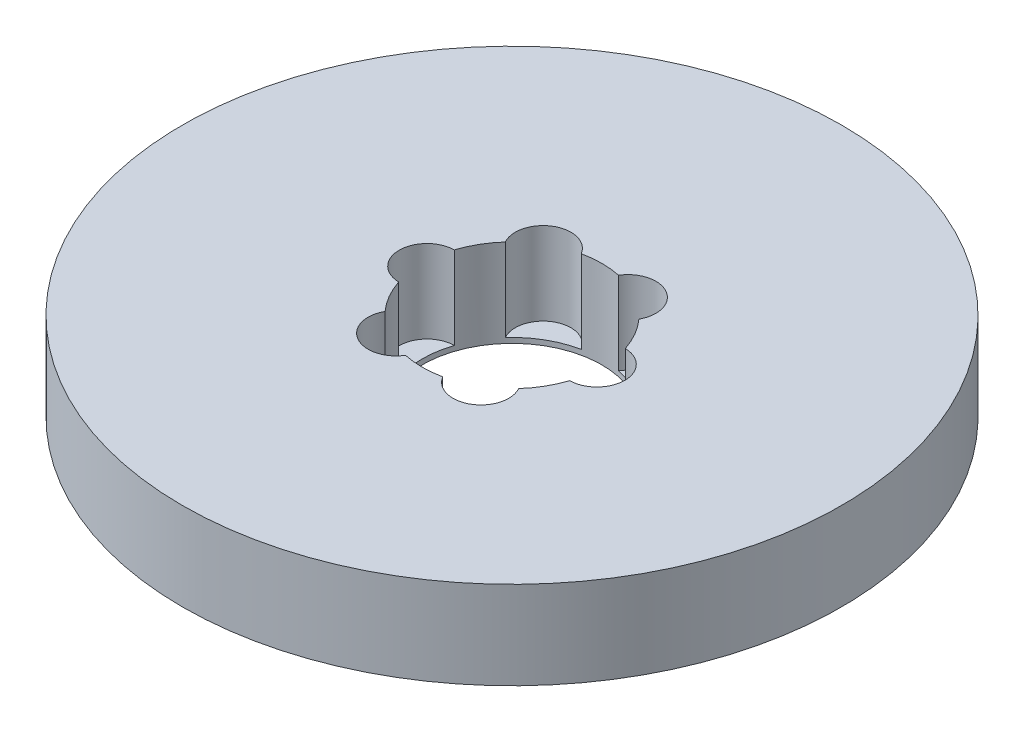
ISO-10303-21;
HEADER;
FILE_DESCRIPTION(('STEP AP214'),'2;1');
FILE_NAME('part.step','',(''),(''),'','','');
FILE_SCHEMA(('AUTOMOTIVE_DESIGN { 1 0 10303 214 1 1 1 1 }'));
ENDSEC;
DATA;
#1=APPLICATION_CONTEXT('core data for automotive mechanical design processes');
#2=APPLICATION_PROTOCOL_DEFINITION('international standard','automotive_design',2000,#1);
#3=PRODUCT_CONTEXT('',#1,'mechanical');
#4=PRODUCT('Part','Part','',(#3));
#5=PRODUCT_RELATED_PRODUCT_CATEGORY('part','',(#4));
#6=PRODUCT_DEFINITION_FORMATION('','',#4);
#7=PRODUCT_DEFINITION_CONTEXT('part definition',#1,'design');
#8=PRODUCT_DEFINITION('design','',#6,#7);
#9=PRODUCT_DEFINITION_SHAPE('','',#8);
#10=(LENGTH_UNIT() NAMED_UNIT(*) SI_UNIT(.MILLI.,.METRE.));
#11=(NAMED_UNIT(*) PLANE_ANGLE_UNIT() SI_UNIT($,.RADIAN.));
#12=(NAMED_UNIT(*) SI_UNIT($,.STERADIAN.) SOLID_ANGLE_UNIT());
#13=UNCERTAINTY_MEASURE_WITH_UNIT(LENGTH_MEASURE(1.E-05),#10,'distance_accuracy_value','');
#14=(GEOMETRIC_REPRESENTATION_CONTEXT(3) GLOBAL_UNCERTAINTY_ASSIGNED_CONTEXT((#13)) GLOBAL_UNIT_ASSIGNED_CONTEXT((#10,
#11,#12)) REPRESENTATION_CONTEXT('',''));
#15=CARTESIAN_POINT('',(0.,0.,0.));
#16=DIRECTION('',(0.,0.,1.));
#17=DIRECTION('',(1.,0.,0.));
#18=AXIS2_PLACEMENT_3D('',#15,#16,#17);
#19=CARTESIAN_POINT('',(0.,22.,0.));
#20=DIRECTION('',(0.,-1.,0.));
#21=DIRECTION('',(0.,0.,-1.));
#22=AXIS2_PLACEMENT_3D('',#19,#20,#21);
#23=CYLINDRICAL_SURFACE('',#22,82.5);
#24=CARTESIAN_POINT('',(0.,22.,0.));
#25=DIRECTION('',(0.,1.,0.));
#26=DIRECTION('',(0.,0.,1.));
#27=AXIS2_PLACEMENT_3D('',#24,#25,#26);
#28=CIRCLE('',#27,82.5);
#29=CARTESIAN_POINT('',(0.,22.,82.5));
#30=VERTEX_POINT('',#29);
#31=EDGE_CURVE('E162',#30,#30,#28,.T.);
#32=ORIENTED_EDGE('',*,*,#31,.F.);
#33=EDGE_LOOP('',(#32));
#34=FACE_BOUND('',#33,.T.);
#35=CARTESIAN_POINT('',(0.,0.,0.));
#36=DIRECTION('',(0.,1.,0.));
#37=DIRECTION('',(0.,0.,1.));
#38=AXIS2_PLACEMENT_3D('',#35,#36,#37);
#39=CIRCLE('',#38,82.5);
#40=CARTESIAN_POINT('',(0.,0.,82.5));
#41=VERTEX_POINT('',#40);
#42=EDGE_CURVE('E157',#41,#41,#39,.T.);
#43=ORIENTED_EDGE('',*,*,#42,.T.);
#44=EDGE_LOOP('',(#43));
#45=FACE_BOUND('',#44,.T.);
#46=ADVANCED_FACE('F39',(#34,#45),#23,.T.);
#47=CARTESIAN_POINT('',(0.,22.,0.));
#48=DIRECTION('',(0.,1.,0.));
#49=DIRECTION('',(0.,0.,1.));
#50=AXIS2_PLACEMENT_3D('',#47,#48,#49);
#51=PLANE('',#50);
#52=CARTESIAN_POINT('',(-10.6352383494133,22.,-18.4207731717883));
#53=DIRECTION('',(0.,1.,0.));
#54=DIRECTION('',(-0.866025403784433,0.,0.50000000000001));
#55=AXIS2_PLACEMENT_3D('',#52,#53,#54);
#56=CIRCLE('',#55,6.96358334406309);
#57=CARTESIAN_POINT('',(-4.66816337565668,22.,-22.0104123245835));
#58=VERTEX_POINT('',#57);
#59=CARTESIAN_POINT('',(-16.7274945330314,22.,-15.0479542346262));
#60=VERTEX_POINT('',#59);
#61=EDGE_CURVE('E218',#58,#60,#56,.T.);
#62=ORIENTED_EDGE('',*,*,#61,.F.);
#63=CARTESIAN_POINT('',(0.,22.,0.));
#64=DIRECTION('',(0.,1.,0.));
#65=DIRECTION('',(0.,0.,1.));
#66=AXIS2_PLACEMENT_3D('',#63,#64,#65);
#67=CIRCLE('',#66,22.5);
#68=CARTESIAN_POINT('',(4.66816337565622,22.,-22.0104123245836));
#69=VERTEX_POINT('',#68);
#70=EDGE_CURVE('E169',#69,#58,#67,.T.);
#71=ORIENTED_EDGE('',*,*,#70,.F.);
#72=CARTESIAN_POINT('',(10.6352383494129,22.,-18.4207731717885));
#73=DIRECTION('',(0.,1.,0.));
#74=DIRECTION('',(-0.866025403784443,0.,-0.499999999999992));
#75=AXIS2_PLACEMENT_3D('',#72,#73,#74);
#76=CIRCLE('',#75,6.96358334406309);
#77=CARTESIAN_POINT('',(16.7274945330311,22.,-15.0479542346265));
#78=VERTEX_POINT('',#77);
#79=EDGE_CURVE('E285',#78,#69,#76,.T.);
#80=ORIENTED_EDGE('',*,*,#79,.F.);
#81=CARTESIAN_POINT('',(21.3956579086877,22.,-6.9624580899572));
#82=VERTEX_POINT('',#81);
#83=EDGE_CURVE('E174',#82,#78,#67,.T.);
#84=ORIENTED_EDGE('',*,*,#83,.F.);
#85=CARTESIAN_POINT('',(21.2704766988261,22.,0.));
#86=DIRECTION('',(0.,1.,0.));
#87=DIRECTION('',(0.,0.,-1.));
#88=AXIS2_PLACEMENT_3D('',#85,#86,#87);
#89=CIRCLE('',#88,6.96358334406309);
#90=CARTESIAN_POINT('',(21.3956579086877,22.,6.9624580899572));
#91=VERTEX_POINT('',#90);
#92=EDGE_CURVE('E280',#91,#82,#89,.T.);
#93=ORIENTED_EDGE('',*,*,#92,.F.);
#94=CARTESIAN_POINT('',(16.7274945330313,22.,15.0479542346263));
#95=VERTEX_POINT('',#94);
#96=EDGE_CURVE('E164',#95,#91,#67,.T.);
#97=ORIENTED_EDGE('',*,*,#96,.F.);
#98=CARTESIAN_POINT('',(10.6352383494132,22.,18.4207731717884));
#99=DIRECTION('',(0.,1.,0.));
#100=DIRECTION('',(0.866025403784436,0.,-0.500000000000004));
#101=AXIS2_PLACEMENT_3D('',#98,#99,#100);
#102=CIRCLE('',#101,6.96358334406309);
#103=CARTESIAN_POINT('',(4.66816337565653,22.,22.0104123245835));
#104=VERTEX_POINT('',#103);
#105=EDGE_CURVE('E269',#104,#95,#102,.T.);
#106=ORIENTED_EDGE('',*,*,#105,.F.);
#107=CARTESIAN_POINT('',(-4.66816337565638,22.,22.0104123245836));
#108=VERTEX_POINT('',#107);
#109=EDGE_CURVE('E149',#108,#104,#67,.T.);
#110=ORIENTED_EDGE('',*,*,#109,.F.);
#111=CARTESIAN_POINT('',(-10.635238349413,22.,18.4207731717884));
#112=DIRECTION('',(0.,1.,0.));
#113=DIRECTION('',(0.86602540378444,0.,0.499999999999998));
#114=AXIS2_PLACEMENT_3D('',#111,#112,#113);
#115=CIRCLE('',#114,6.96358334406309);
#116=CARTESIAN_POINT('',(-16.7274945330312,22.,15.0479542346264));
#117=VERTEX_POINT('',#116);
#118=EDGE_CURVE('E128',#117,#108,#115,.T.);
#119=ORIENTED_EDGE('',*,*,#118,.F.);
#120=CARTESIAN_POINT('',(-21.3956579086877,22.,6.9624580899572));
#121=VERTEX_POINT('',#120);
#122=EDGE_CURVE('E148',#121,#117,#67,.T.);
#123=ORIENTED_EDGE('',*,*,#122,.F.);
#124=CARTESIAN_POINT('',(-21.2704766988261,22.,0.));
#125=DIRECTION('',(0.,1.,0.));
#126=DIRECTION('',(0.,0.,1.));
#127=AXIS2_PLACEMENT_3D('',#124,#125,#126);
#128=CIRCLE('',#127,6.96358334406309);
#129=CARTESIAN_POINT('',(-21.3956579086877,22.,-6.9624580899572));
#130=VERTEX_POINT('',#129);
#131=EDGE_CURVE('E179',#130,#121,#128,.T.);
#132=ORIENTED_EDGE('',*,*,#131,.F.);
#133=EDGE_CURVE('E161',#60,#130,#67,.T.);
#134=ORIENTED_EDGE('',*,*,#133,.F.);
#135=EDGE_LOOP('',(#62,#71,#80,#84,#93,#97,#106,#110,#119,#123,#132,#134));
#136=FACE_BOUND('',#135,.T.);
#137=ORIENTED_EDGE('',*,*,#31,.T.);
#138=EDGE_LOOP('',(#137));
#139=FACE_BOUND('',#138,.T.);
#140=ADVANCED_FACE('F141',(#136,#139),#51,.T.);
#141=CARTESIAN_POINT('',(0.,0.,0.));
#142=DIRECTION('',(0.,1.,0.));
#143=DIRECTION('',(0.,0.,1.));
#144=AXIS2_PLACEMENT_3D('',#141,#142,#143);
#145=PLANE('',#144);
#146=CARTESIAN_POINT('',(0.,0.,0.));
#147=DIRECTION('',(0.,1.,0.));
#148=DIRECTION('',(0.,0.,1.));
#149=AXIS2_PLACEMENT_3D('',#146,#147,#148);
#150=CIRCLE('',#149,22.5);
#151=CARTESIAN_POINT('',(0.,0.,22.5));
#152=VERTEX_POINT('',#151);
#153=EDGE_CURVE('E166',#152,#152,#150,.T.);
#154=ORIENTED_EDGE('',*,*,#153,.T.);
#155=EDGE_LOOP('',(#154));
#156=FACE_BOUND('',#155,.T.);
#157=ORIENTED_EDGE('',*,*,#42,.F.);
#158=EDGE_LOOP('',(#157));
#159=FACE_BOUND('',#158,.T.);
#160=ADVANCED_FACE('F234',(#156,#159),#145,.F.);
#161=CARTESIAN_POINT('',(0.,22.,0.));
#162=DIRECTION('',(0.,-1.,0.));
#163=DIRECTION('',(0.,0.,-1.));
#164=AXIS2_PLACEMENT_3D('',#161,#162,#163);
#165=CYLINDRICAL_SURFACE('',#164,22.5);
#166=DIRECTION('',(0.,1.,0.));
#167=VECTOR('',#166,1.);
#168=CARTESIAN_POINT('',(-4.66816337565668,11.6438447763558,-22.0104123245835));
#169=LINE('',#168,#167);
#170=CARTESIAN_POINT('',(-4.66816337565668,1.28768955271167,-22.0104123245835));
#171=VERTEX_POINT('',#170);
#172=EDGE_CURVE('E11',#171,#58,#169,.T.);
#173=ORIENTED_EDGE('',*,*,#172,.F.);
#174=CARTESIAN_POINT('',(0.,1.28768955271167,0.));
#175=DIRECTION('',(0.,1.,0.));
#176=DIRECTION('',(0.,0.,1.));
#177=AXIS2_PLACEMENT_3D('',#174,#175,#176);
#178=CIRCLE('',#177,22.5);
#179=CARTESIAN_POINT('',(-16.7274945330314,1.28768955271167,-15.0479542346262));
#180=VERTEX_POINT('',#179);
#181=EDGE_CURVE('E214',#171,#180,#178,.T.);
#182=ORIENTED_EDGE('',*,*,#181,.T.);
#183=DIRECTION('',(0.,1.,0.));
#184=VECTOR('',#183,1.);
#185=CARTESIAN_POINT('',(-16.7274945330314,11.6438447763558,-15.0479542346262));
#186=LINE('',#185,#184);
#187=EDGE_CURVE('E46',#60,#180,#186,.F.);
#188=ORIENTED_EDGE('',*,*,#187,.F.);
#189=ORIENTED_EDGE('',*,*,#133,.T.);
#190=DIRECTION('',(0.,1.,0.));
#191=VECTOR('',#190,1.);
#192=CARTESIAN_POINT('',(-21.3956579086877,11.6438447763558,-6.9624580899572));
#193=LINE('',#192,#191);
#194=CARTESIAN_POINT('',(-21.3956579086877,1.28768955271167,-6.9624580899572));
#195=VERTEX_POINT('',#194);
#196=EDGE_CURVE('E187',#195,#130,#193,.T.);
#197=ORIENTED_EDGE('',*,*,#196,.F.);
#198=CARTESIAN_POINT('',(0.,1.28768955271167,0.));
#199=DIRECTION('',(0.,1.,0.));
#200=DIRECTION('',(0.,0.,1.));
#201=AXIS2_PLACEMENT_3D('',#198,#199,#200);
#202=CIRCLE('',#201,22.5);
#203=CARTESIAN_POINT('',(-21.3956579086877,1.28768955271167,6.9624580899572));
#204=VERTEX_POINT('',#203);
#205=EDGE_CURVE('E184',#195,#204,#202,.T.);
#206=ORIENTED_EDGE('',*,*,#205,.T.);
#207=DIRECTION('',(0.,1.,0.));
#208=VECTOR('',#207,1.);
#209=CARTESIAN_POINT('',(-21.3956579086877,11.6438447763558,6.9624580899572));
#210=LINE('',#209,#208);
#211=EDGE_CURVE('E158',#121,#204,#210,.F.);
#212=ORIENTED_EDGE('',*,*,#211,.F.);
#213=ORIENTED_EDGE('',*,*,#122,.T.);
#214=DIRECTION('',(0.,1.,0.));
#215=VECTOR('',#214,1.);
#216=CARTESIAN_POINT('',(-16.7274945330312,11.6438447763558,15.0479542346264));
#217=LINE('',#216,#215);
#218=CARTESIAN_POINT('',(-16.7274945330312,1.28768955271167,15.0479542346264));
#219=VERTEX_POINT('',#218);
#220=EDGE_CURVE('E127',#219,#117,#217,.T.);
#221=ORIENTED_EDGE('',*,*,#220,.F.);
#222=CARTESIAN_POINT('',(0.,1.28768955271167,0.));
#223=DIRECTION('',(0.,1.,0.));
#224=DIRECTION('',(0.,0.,1.));
#225=AXIS2_PLACEMENT_3D('',#222,#223,#224);
#226=CIRCLE('',#225,22.5);
#227=CARTESIAN_POINT('',(-4.66816337565638,1.28768955271167,22.0104123245836));
#228=VERTEX_POINT('',#227);
#229=EDGE_CURVE('E189',#219,#228,#226,.T.);
#230=ORIENTED_EDGE('',*,*,#229,.T.);
#231=DIRECTION('',(0.,1.,0.));
#232=VECTOR('',#231,1.);
#233=CARTESIAN_POINT('',(-4.66816337565637,11.6438447763558,22.0104123245836));
#234=LINE('',#233,#232);
#235=EDGE_CURVE('E140',#108,#228,#234,.F.);
#236=ORIENTED_EDGE('',*,*,#235,.F.);
#237=ORIENTED_EDGE('',*,*,#109,.T.);
#238=DIRECTION('',(0.,1.,0.));
#239=VECTOR('',#238,1.);
#240=CARTESIAN_POINT('',(4.66816337565653,11.6438447763558,22.0104123245835));
#241=LINE('',#240,#239);
#242=CARTESIAN_POINT('',(4.66816337565653,1.28768955271167,22.0104123245835));
#243=VERTEX_POINT('',#242);
#244=EDGE_CURVE('E196',#243,#104,#241,.T.);
#245=ORIENTED_EDGE('',*,*,#244,.F.);
#246=CARTESIAN_POINT('',(0.,1.28768955271167,0.));
#247=DIRECTION('',(0.,1.,0.));
#248=DIRECTION('',(0.,0.,1.));
#249=AXIS2_PLACEMENT_3D('',#246,#247,#248);
#250=CIRCLE('',#249,22.5);
#251=CARTESIAN_POINT('',(16.7274945330313,1.28768955271167,15.0479542346263));
#252=VERTEX_POINT('',#251);
#253=EDGE_CURVE('E136',#243,#252,#250,.T.);
#254=ORIENTED_EDGE('',*,*,#253,.T.);
#255=DIRECTION('',(0.,1.,0.));
#256=VECTOR('',#255,1.);
#257=CARTESIAN_POINT('',(16.7274945330313,11.6438447763558,15.0479542346263));
#258=LINE('',#257,#256);
#259=EDGE_CURVE('E194',#95,#252,#258,.F.);
#260=ORIENTED_EDGE('',*,*,#259,.F.);
#261=ORIENTED_EDGE('',*,*,#96,.T.);
#262=DIRECTION('',(0.,1.,0.));
#263=VECTOR('',#262,1.);
#264=CARTESIAN_POINT('',(21.3956579086877,11.6438447763558,6.9624580899572));
#265=LINE('',#264,#263);
#266=CARTESIAN_POINT('',(21.3956579086877,1.28768955271167,6.9624580899572));
#267=VERTEX_POINT('',#266);
#268=EDGE_CURVE('E206',#267,#91,#265,.T.);
#269=ORIENTED_EDGE('',*,*,#268,.F.);
#270=CARTESIAN_POINT('',(0.,1.28768955271167,0.));
#271=DIRECTION('',(0.,1.,0.));
#272=DIRECTION('',(0.,0.,1.));
#273=AXIS2_PLACEMENT_3D('',#270,#271,#272);
#274=CIRCLE('',#273,22.5);
#275=CARTESIAN_POINT('',(21.3956579086877,1.28768955271167,-6.9624580899572));
#276=VERTEX_POINT('',#275);
#277=EDGE_CURVE('E199',#267,#276,#274,.T.);
#278=ORIENTED_EDGE('',*,*,#277,.T.);
#279=DIRECTION('',(0.,1.,0.));
#280=VECTOR('',#279,1.);
#281=CARTESIAN_POINT('',(21.3956579086877,11.6438447763558,-6.9624580899572));
#282=LINE('',#281,#280);
#283=EDGE_CURVE('E201',#82,#276,#282,.F.);
#284=ORIENTED_EDGE('',*,*,#283,.F.);
#285=ORIENTED_EDGE('',*,*,#83,.T.);
#286=DIRECTION('',(0.,1.,0.));
#287=VECTOR('',#286,1.);
#288=CARTESIAN_POINT('',(16.7274945330311,11.6438447763558,-15.0479542346265));
#289=LINE('',#288,#287);
#290=CARTESIAN_POINT('',(16.7274945330311,1.28768955271167,-15.0479542346265));
#291=VERTEX_POINT('',#290);
#292=EDGE_CURVE('E213',#291,#78,#289,.T.);
#293=ORIENTED_EDGE('',*,*,#292,.F.);
#294=CARTESIAN_POINT('',(0.,1.28768955271167,0.));
#295=DIRECTION('',(0.,1.,0.));
#296=DIRECTION('',(0.,0.,1.));
#297=AXIS2_PLACEMENT_3D('',#294,#295,#296);
#298=CIRCLE('',#297,22.5);
#299=CARTESIAN_POINT('',(4.66816337565622,1.28768955271167,-22.0104123245836));
#300=VERTEX_POINT('',#299);
#301=EDGE_CURVE('E208',#291,#300,#298,.T.);
#302=ORIENTED_EDGE('',*,*,#301,.T.);
#303=DIRECTION('',(0.,1.,0.));
#304=VECTOR('',#303,1.);
#305=CARTESIAN_POINT('',(4.66816337565622,11.6438447763558,-22.0104123245836));
#306=LINE('',#305,#304);
#307=EDGE_CURVE('E211',#69,#300,#306,.F.);
#308=ORIENTED_EDGE('',*,*,#307,.F.);
#309=ORIENTED_EDGE('',*,*,#70,.T.);
#310=EDGE_LOOP('',(#173,#182,#188,#189,#197,#206,#212,#213,#221,#230,#236,#237,#245,#254,#260,
#261,#269,#278,#284,#285,#293,#302,#308,#309));
#311=FACE_BOUND('',#310,.T.);
#312=ORIENTED_EDGE('',*,*,#153,.F.);
#313=EDGE_LOOP('',(#312));
#314=FACE_BOUND('',#313,.T.);
#315=ADVANCED_FACE('F152',(#311,#314),#165,.F.);
#316=CARTESIAN_POINT('',(-21.2704766988261,1.28768955271167,0.));
#317=DIRECTION('',(0.,1.,0.));
#318=DIRECTION('',(0.,0.,1.));
#319=AXIS2_PLACEMENT_3D('',#316,#317,#318);
#320=CYLINDRICAL_SURFACE('',#319,6.96358334406309);
#321=ORIENTED_EDGE('',*,*,#196,.T.);
#322=ORIENTED_EDGE('',*,*,#131,.T.);
#323=ORIENTED_EDGE('',*,*,#211,.T.);
#324=CARTESIAN_POINT('',(-21.2704766988261,1.28768955271167,0.));
#325=DIRECTION('',(0.,1.,0.));
#326=DIRECTION('',(0.,0.,1.));
#327=AXIS2_PLACEMENT_3D('',#324,#325,#326);
#328=CIRCLE('',#327,6.96358334406309);
#329=EDGE_CURVE('E180',#195,#204,#328,.T.);
#330=ORIENTED_EDGE('',*,*,#329,.F.);
#331=EDGE_LOOP('',(#321,#322,#323,#330));
#332=FACE_BOUND('',#331,.T.);
#333=ADVANCED_FACE('F244',(#332),#320,.F.);
#334=CARTESIAN_POINT('',(-21.2704766988261,1.28768955271167,0.));
#335=DIRECTION('',(0.,1.,0.));
#336=DIRECTION('',(0.,0.,1.));
#337=AXIS2_PLACEMENT_3D('',#334,#335,#336);
#338=PLANE('',#337);
#339=ORIENTED_EDGE('',*,*,#329,.T.);
#340=ORIENTED_EDGE('',*,*,#205,.F.);
#341=EDGE_LOOP('',(#339,#340));
#342=FACE_BOUND('',#341,.T.);
#343=ADVANCED_FACE('F248',(#342),#338,.T.);
#344=CARTESIAN_POINT('',(-10.635238349413,1.28768955271167,18.4207731717884));
#345=DIRECTION('',(0.,1.,0.));
#346=DIRECTION('',(0.,0.,1.));
#347=AXIS2_PLACEMENT_3D('',#344,#345,#346);
#348=CYLINDRICAL_SURFACE('',#347,6.96358334406309);
#349=ORIENTED_EDGE('',*,*,#220,.T.);
#350=ORIENTED_EDGE('',*,*,#118,.T.);
#351=ORIENTED_EDGE('',*,*,#235,.T.);
#352=CARTESIAN_POINT('',(-10.635238349413,1.28768955271167,18.4207731717884));
#353=DIRECTION('',(0.,1.,0.));
#354=DIRECTION('',(0.86602540378444,0.,0.499999999999998));
#355=AXIS2_PLACEMENT_3D('',#352,#353,#354);
#356=CIRCLE('',#355,6.96358334406309);
#357=EDGE_CURVE('E135',#219,#228,#356,.T.);
#358=ORIENTED_EDGE('',*,*,#357,.F.);
#359=EDGE_LOOP('',(#349,#350,#351,#358));
#360=FACE_BOUND('',#359,.T.);
#361=ADVANCED_FACE('F126',(#360),#348,.F.);
#362=CARTESIAN_POINT('',(-10.635238349413,1.28768955271167,18.4207731717884));
#363=DIRECTION('',(0.,1.,0.));
#364=DIRECTION('',(0.86602540378444,0.,0.499999999999998));
#365=AXIS2_PLACEMENT_3D('',#362,#363,#364);
#366=PLANE('',#365);
#367=ORIENTED_EDGE('',*,*,#357,.T.);
#368=ORIENTED_EDGE('',*,*,#229,.F.);
#369=EDGE_LOOP('',(#367,#368));
#370=FACE_BOUND('',#369,.T.);
#371=ADVANCED_FACE('F258',(#370),#366,.T.);
#372=CARTESIAN_POINT('',(10.6352383494132,1.28768955271167,18.4207731717884));
#373=DIRECTION('',(0.,1.,0.));
#374=DIRECTION('',(0.,0.,1.));
#375=AXIS2_PLACEMENT_3D('',#372,#373,#374);
#376=CYLINDRICAL_SURFACE('',#375,6.96358334406309);
#377=ORIENTED_EDGE('',*,*,#244,.T.);
#378=ORIENTED_EDGE('',*,*,#105,.T.);
#379=ORIENTED_EDGE('',*,*,#259,.T.);
#380=CARTESIAN_POINT('',(10.6352383494132,1.28768955271167,18.4207731717884));
#381=DIRECTION('',(0.,1.,0.));
#382=DIRECTION('',(0.866025403784436,0.,-0.500000000000004));
#383=AXIS2_PLACEMENT_3D('',#380,#381,#382);
#384=CIRCLE('',#383,6.96358334406309);
#385=EDGE_CURVE('E147',#243,#252,#384,.T.);
#386=ORIENTED_EDGE('',*,*,#385,.F.);
#387=EDGE_LOOP('',(#377,#378,#379,#386));
#388=FACE_BOUND('',#387,.T.);
#389=ADVANCED_FACE('F256',(#388),#376,.F.);
#390=CARTESIAN_POINT('',(10.6352383494132,1.28768955271167,18.4207731717884));
#391=DIRECTION('',(0.,1.,0.));
#392=DIRECTION('',(0.866025403784436,0.,-0.500000000000004));
#393=AXIS2_PLACEMENT_3D('',#390,#391,#392);
#394=PLANE('',#393);
#395=ORIENTED_EDGE('',*,*,#385,.T.);
#396=ORIENTED_EDGE('',*,*,#253,.F.);
#397=EDGE_LOOP('',(#395,#396));
#398=FACE_BOUND('',#397,.T.);
#399=ADVANCED_FACE('F263',(#398),#394,.T.);
#400=CARTESIAN_POINT('',(21.2704766988261,1.28768955271167,0.));
#401=DIRECTION('',(0.,1.,0.));
#402=DIRECTION('',(0.,0.,1.));
#403=AXIS2_PLACEMENT_3D('',#400,#401,#402);
#404=CYLINDRICAL_SURFACE('',#403,6.96358334406309);
#405=ORIENTED_EDGE('',*,*,#268,.T.);
#406=ORIENTED_EDGE('',*,*,#92,.T.);
#407=ORIENTED_EDGE('',*,*,#283,.T.);
#408=CARTESIAN_POINT('',(21.2704766988261,1.28768955271167,0.));
#409=DIRECTION('',(0.,1.,0.));
#410=DIRECTION('',(0.,0.,-1.));
#411=AXIS2_PLACEMENT_3D('',#408,#409,#410);
#412=CIRCLE('',#411,6.96358334406309);
#413=EDGE_CURVE('E273',#267,#276,#412,.T.);
#414=ORIENTED_EDGE('',*,*,#413,.F.);
#415=EDGE_LOOP('',(#405,#406,#407,#414));
#416=FACE_BOUND('',#415,.T.);
#417=ADVANCED_FACE('F297',(#416),#404,.F.);
#418=CARTESIAN_POINT('',(21.2704766988261,1.28768955271167,0.));
#419=DIRECTION('',(0.,1.,0.));
#420=DIRECTION('',(0.,0.,-1.));
#421=AXIS2_PLACEMENT_3D('',#418,#419,#420);
#422=PLANE('',#421);
#423=ORIENTED_EDGE('',*,*,#413,.T.);
#424=ORIENTED_EDGE('',*,*,#277,.F.);
#425=EDGE_LOOP('',(#423,#424));
#426=FACE_BOUND('',#425,.T.);
#427=ADVANCED_FACE('F299',(#426),#422,.T.);
#428=CARTESIAN_POINT('',(10.6352383494129,1.28768955271167,-18.4207731717885));
#429=DIRECTION('',(0.,1.,0.));
#430=DIRECTION('',(0.,0.,1.));
#431=AXIS2_PLACEMENT_3D('',#428,#429,#430);
#432=CYLINDRICAL_SURFACE('',#431,6.96358334406309);
#433=ORIENTED_EDGE('',*,*,#292,.T.);
#434=ORIENTED_EDGE('',*,*,#79,.T.);
#435=ORIENTED_EDGE('',*,*,#307,.T.);
#436=CARTESIAN_POINT('',(10.6352383494129,1.28768955271167,-18.4207731717885));
#437=DIRECTION('',(0.,1.,0.));
#438=DIRECTION('',(-0.866025403784443,0.,-0.499999999999992));
#439=AXIS2_PLACEMENT_3D('',#436,#437,#438);
#440=CIRCLE('',#439,6.96358334406309);
#441=EDGE_CURVE('E56',#291,#300,#440,.T.);
#442=ORIENTED_EDGE('',*,*,#441,.F.);
#443=EDGE_LOOP('',(#433,#434,#435,#442));
#444=FACE_BOUND('',#443,.T.);
#445=ADVANCED_FACE('F292',(#444),#432,.F.);
#446=CARTESIAN_POINT('',(10.6352383494129,1.28768955271167,-18.4207731717885));
#447=DIRECTION('',(0.,1.,0.));
#448=DIRECTION('',(-0.866025403784443,0.,-0.499999999999992));
#449=AXIS2_PLACEMENT_3D('',#446,#447,#448);
#450=PLANE('',#449);
#451=ORIENTED_EDGE('',*,*,#441,.T.);
#452=ORIENTED_EDGE('',*,*,#301,.F.);
#453=EDGE_LOOP('',(#451,#452));
#454=FACE_BOUND('',#453,.T.);
#455=ADVANCED_FACE('F226',(#454),#450,.T.);
#456=CARTESIAN_POINT('',(-10.6352383494133,1.28768955271167,-18.4207731717883));
#457=DIRECTION('',(0.,1.,0.));
#458=DIRECTION('',(0.,0.,1.));
#459=AXIS2_PLACEMENT_3D('',#456,#457,#458);
#460=CYLINDRICAL_SURFACE('',#459,6.96358334406309);
#461=ORIENTED_EDGE('',*,*,#172,.T.);
#462=ORIENTED_EDGE('',*,*,#61,.T.);
#463=ORIENTED_EDGE('',*,*,#187,.T.);
#464=CARTESIAN_POINT('',(-10.6352383494133,1.28768955271167,-18.4207731717883));
#465=DIRECTION('',(0.,1.,0.));
#466=DIRECTION('',(-0.866025403784433,0.,0.50000000000001));
#467=AXIS2_PLACEMENT_3D('',#464,#465,#466);
#468=CIRCLE('',#467,6.96358334406309);
#469=EDGE_CURVE('E55',#171,#180,#468,.T.);
#470=ORIENTED_EDGE('',*,*,#469,.F.);
#471=EDGE_LOOP('',(#461,#462,#463,#470));
#472=FACE_BOUND('',#471,.T.);
#473=ADVANCED_FACE('F217',(#472),#460,.F.);
#474=CARTESIAN_POINT('',(-10.6352383494133,1.28768955271167,-18.4207731717883));
#475=DIRECTION('',(0.,1.,0.));
#476=DIRECTION('',(-0.866025403784433,0.,0.50000000000001));
#477=AXIS2_PLACEMENT_3D('',#474,#475,#476);
#478=PLANE('',#477);
#479=ORIENTED_EDGE('',*,*,#469,.T.);
#480=ORIENTED_EDGE('',*,*,#181,.F.);
#481=EDGE_LOOP('',(#479,#480));
#482=FACE_BOUND('',#481,.T.);
#483=ADVANCED_FACE('F219',(#482),#478,.T.);
#484=CLOSED_SHELL('',(#46,#140,#160,#315,#333,#343,#361,#371,#389,#399,#417,#427,#445,#455,#473,#483));
#485=MANIFOLD_SOLID_BREP('B2',#484);
#486=ADVANCED_BREP_SHAPE_REPRESENTATION('',(#18,#485),#14);
#487=SHAPE_DEFINITION_REPRESENTATION(#9,#486);
ENDSEC;
END-ISO-10303-21;
